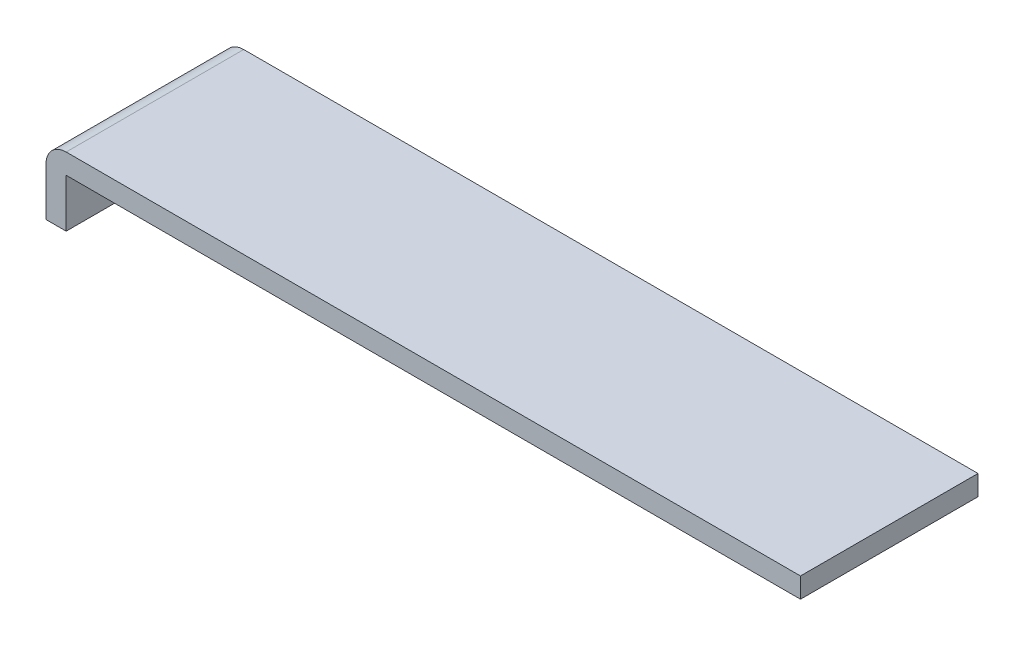
ISO-10303-21;
HEADER;
FILE_DESCRIPTION(('STEP AP214'),'2;1');
FILE_NAME('part.step','',(''),(''),'','','');
FILE_SCHEMA(('AUTOMOTIVE_DESIGN { 1 0 10303 214 1 1 1 1 }'));
ENDSEC;
DATA;
#1=APPLICATION_CONTEXT('core data for automotive mechanical design processes');
#2=APPLICATION_PROTOCOL_DEFINITION('international standard','automotive_design',2000,#1);
#3=PRODUCT_CONTEXT('',#1,'mechanical');
#4=PRODUCT('Part','Part','',(#3));
#5=PRODUCT_RELATED_PRODUCT_CATEGORY('part','',(#4));
#6=PRODUCT_DEFINITION_FORMATION('','',#4);
#7=PRODUCT_DEFINITION_CONTEXT('part definition',#1,'design');
#8=PRODUCT_DEFINITION('design','',#6,#7);
#9=PRODUCT_DEFINITION_SHAPE('','',#8);
#10=(LENGTH_UNIT() NAMED_UNIT(*) SI_UNIT(.MILLI.,.METRE.));
#11=(NAMED_UNIT(*) PLANE_ANGLE_UNIT() SI_UNIT($,.RADIAN.));
#12=(NAMED_UNIT(*) SI_UNIT($,.STERADIAN.) SOLID_ANGLE_UNIT());
#13=UNCERTAINTY_MEASURE_WITH_UNIT(LENGTH_MEASURE(1.E-05),#10,'distance_accuracy_value','');
#14=(GEOMETRIC_REPRESENTATION_CONTEXT(3) GLOBAL_UNCERTAINTY_ASSIGNED_CONTEXT((#13)) GLOBAL_UNIT_ASSIGNED_CONTEXT((#10,
#11,#12)) REPRESENTATION_CONTEXT('',''));
#15=CARTESIAN_POINT('',(0.,0.,0.));
#16=DIRECTION('',(0.,0.,1.));
#17=DIRECTION('',(1.,0.,0.));
#18=AXIS2_PLACEMENT_3D('',#15,#16,#17);
#19=CARTESIAN_POINT('',(0.5,0.,4.4));
#20=DIRECTION('',(0.,1.,0.));
#21=DIRECTION('',(-1.,0.,0.));
#22=AXIS2_PLACEMENT_3D('',#19,#20,#21);
#23=PLANE('',#22);
#24=DIRECTION('',(1.,0.,0.));
#25=VECTOR('',#24,1.);
#26=CARTESIAN_POINT('',(0.5,0.,0.));
#27=LINE('',#26,#25);
#28=CARTESIAN_POINT('',(0.,0.,0.));
#29=VERTEX_POINT('',#28);
#30=CARTESIAN_POINT('',(0.5,0.,0.));
#31=VERTEX_POINT('',#30);
#32=EDGE_CURVE('E117',#29,#31,#27,.T.);
#33=ORIENTED_EDGE('',*,*,#32,.T.);
#34=DIRECTION('',(0.,0.,-1.));
#35=VECTOR('',#34,1.);
#36=CARTESIAN_POINT('',(0.5,0.,4.4));
#37=LINE('',#36,#35);
#38=CARTESIAN_POINT('',(0.5,0.,4.4));
#39=VERTEX_POINT('',#38);
#40=EDGE_CURVE('E98',#39,#31,#37,.T.);
#41=ORIENTED_EDGE('',*,*,#40,.F.);
#42=DIRECTION('',(1.,0.,0.));
#43=VECTOR('',#42,1.);
#44=CARTESIAN_POINT('',(0.5,0.,4.4));
#45=LINE('',#44,#43);
#46=CARTESIAN_POINT('',(0.,0.,4.4));
#47=VERTEX_POINT('',#46);
#48=EDGE_CURVE('E105',#47,#39,#45,.T.);
#49=ORIENTED_EDGE('',*,*,#48,.F.);
#50=DIRECTION('',(0.,0.,-1.));
#51=VECTOR('',#50,1.);
#52=CARTESIAN_POINT('',(0.,0.,4.4));
#53=LINE('',#52,#51);
#54=EDGE_CURVE('E131',#47,#29,#53,.T.);
#55=ORIENTED_EDGE('',*,*,#54,.T.);
#56=EDGE_LOOP('',(#33,#41,#49,#55));
#57=FACE_BOUND('',#56,.T.);
#58=ADVANCED_FACE('F35',(#57),#23,.F.);
#59=CARTESIAN_POINT('',(0.5,1.2,4.4));
#60=DIRECTION('',(-1.,0.,0.));
#61=DIRECTION('',(0.,-1.,0.));
#62=AXIS2_PLACEMENT_3D('',#59,#60,#61);
#63=PLANE('',#62);
#64=DIRECTION('',(0.,1.,0.));
#65=VECTOR('',#64,1.);
#66=CARTESIAN_POINT('',(0.5,1.2,0.));
#67=LINE('',#66,#65);
#68=CARTESIAN_POINT('',(0.5,1.2,0.));
#69=VERTEX_POINT('',#68);
#70=EDGE_CURVE('E140',#31,#69,#67,.T.);
#71=ORIENTED_EDGE('',*,*,#70,.T.);
#72=DIRECTION('',(0.,0.,-1.));
#73=VECTOR('',#72,1.);
#74=CARTESIAN_POINT('',(0.5,1.2,4.4));
#75=LINE('',#74,#73);
#76=CARTESIAN_POINT('',(0.5,1.2,4.4));
#77=VERTEX_POINT('',#76);
#78=EDGE_CURVE('E101',#77,#69,#75,.T.);
#79=ORIENTED_EDGE('',*,*,#78,.F.);
#80=DIRECTION('',(0.,1.,0.));
#81=VECTOR('',#80,1.);
#82=CARTESIAN_POINT('',(0.5,1.2,4.4));
#83=LINE('',#82,#81);
#84=EDGE_CURVE('E94',#39,#77,#83,.T.);
#85=ORIENTED_EDGE('',*,*,#84,.F.);
#86=ORIENTED_EDGE('',*,*,#40,.T.);
#87=EDGE_LOOP('',(#71,#79,#85,#86));
#88=FACE_BOUND('',#87,.T.);
#89=ADVANCED_FACE('F96',(#88),#63,.F.);
#90=CARTESIAN_POINT('',(18.7,1.2,4.4));
#91=DIRECTION('',(0.,1.,0.));
#92=DIRECTION('',(-1.,0.,0.));
#93=AXIS2_PLACEMENT_3D('',#90,#91,#92);
#94=PLANE('',#93);
#95=DIRECTION('',(1.,0.,0.));
#96=VECTOR('',#95,1.);
#97=CARTESIAN_POINT('',(18.7,1.2,0.));
#98=LINE('',#97,#96);
#99=CARTESIAN_POINT('',(18.7,1.2,0.));
#100=VERTEX_POINT('',#99);
#101=EDGE_CURVE('E138',#69,#100,#98,.T.);
#102=ORIENTED_EDGE('',*,*,#101,.T.);
#103=DIRECTION('',(0.,0.,-1.));
#104=VECTOR('',#103,1.);
#105=CARTESIAN_POINT('',(18.7,1.2,4.4));
#106=LINE('',#105,#104);
#107=CARTESIAN_POINT('',(18.7,1.2,4.4));
#108=VERTEX_POINT('',#107);
#109=EDGE_CURVE('E122',#108,#100,#106,.T.);
#110=ORIENTED_EDGE('',*,*,#109,.F.);
#111=DIRECTION('',(1.,0.,0.));
#112=VECTOR('',#111,1.);
#113=CARTESIAN_POINT('',(18.7,1.2,4.4));
#114=LINE('',#113,#112);
#115=EDGE_CURVE('E104',#77,#108,#114,.T.);
#116=ORIENTED_EDGE('',*,*,#115,.F.);
#117=ORIENTED_EDGE('',*,*,#78,.T.);
#118=EDGE_LOOP('',(#102,#110,#116,#117));
#119=FACE_BOUND('',#118,.T.);
#120=ADVANCED_FACE('F152',(#119),#94,.F.);
#121=CARTESIAN_POINT('',(18.7,1.7,4.4));
#122=DIRECTION('',(-1.,0.,0.));
#123=DIRECTION('',(0.,0.,1.));
#124=AXIS2_PLACEMENT_3D('',#121,#122,#123);
#125=PLANE('',#124);
#126=DIRECTION('',(0.,1.,0.));
#127=VECTOR('',#126,1.);
#128=CARTESIAN_POINT('',(18.7,1.7,0.));
#129=LINE('',#128,#127);
#130=CARTESIAN_POINT('',(18.7,1.7,0.));
#131=VERTEX_POINT('',#130);
#132=EDGE_CURVE('E136',#100,#131,#129,.T.);
#133=ORIENTED_EDGE('',*,*,#132,.T.);
#134=DIRECTION('',(0.,0.,-1.));
#135=VECTOR('',#134,1.);
#136=CARTESIAN_POINT('',(18.7,1.7,4.4));
#137=LINE('',#136,#135);
#138=CARTESIAN_POINT('',(18.7,1.7,4.4));
#139=VERTEX_POINT('',#138);
#140=EDGE_CURVE('E128',#139,#131,#137,.T.);
#141=ORIENTED_EDGE('',*,*,#140,.F.);
#142=DIRECTION('',(0.,1.,0.));
#143=VECTOR('',#142,1.);
#144=CARTESIAN_POINT('',(18.7,1.7,4.4));
#145=LINE('',#144,#143);
#146=EDGE_CURVE('E146',#108,#139,#145,.T.);
#147=ORIENTED_EDGE('',*,*,#146,.F.);
#148=ORIENTED_EDGE('',*,*,#109,.T.);
#149=EDGE_LOOP('',(#133,#141,#147,#148));
#150=FACE_BOUND('',#149,.T.);
#151=ADVANCED_FACE('F156',(#150),#125,.F.);
#152=CARTESIAN_POINT('',(0.,1.7,4.4));
#153=DIRECTION('',(0.,-1.,0.));
#154=DIRECTION('',(0.,0.,-1.));
#155=AXIS2_PLACEMENT_3D('',#152,#153,#154);
#156=PLANE('',#155);
#157=DIRECTION('',(-1.,0.,0.));
#158=VECTOR('',#157,1.);
#159=CARTESIAN_POINT('',(0.,1.7,0.));
#160=LINE('',#159,#158);
#161=CARTESIAN_POINT('',(0.5,1.7,0.));
#162=VERTEX_POINT('',#161);
#163=EDGE_CURVE('E134',#131,#162,#160,.T.);
#164=ORIENTED_EDGE('',*,*,#163,.T.);
#165=DIRECTION('',(0.,0.,-1.));
#166=VECTOR('',#165,1.);
#167=CARTESIAN_POINT('',(0.5,1.7,4.4));
#168=LINE('',#167,#166);
#169=CARTESIAN_POINT('',(0.5,1.7,4.4));
#170=VERTEX_POINT('',#169);
#171=EDGE_CURVE('E43',#162,#170,#168,.F.);
#172=ORIENTED_EDGE('',*,*,#171,.T.);
#173=DIRECTION('',(-1.,0.,0.));
#174=VECTOR('',#173,1.);
#175=CARTESIAN_POINT('',(0.,1.7,4.4));
#176=LINE('',#175,#174);
#177=EDGE_CURVE('E144',#139,#170,#176,.T.);
#178=ORIENTED_EDGE('',*,*,#177,.F.);
#179=ORIENTED_EDGE('',*,*,#140,.T.);
#180=EDGE_LOOP('',(#164,#172,#178,#179));
#181=FACE_BOUND('',#180,.T.);
#182=ADVANCED_FACE('F157',(#181),#156,.F.);
#183=CARTESIAN_POINT('',(0.,0.,4.4));
#184=DIRECTION('',(1.,0.,0.));
#185=DIRECTION('',(0.,0.,-1.));
#186=AXIS2_PLACEMENT_3D('',#183,#184,#185);
#187=PLANE('',#186);
#188=DIRECTION('',(0.,-1.,0.));
#189=VECTOR('',#188,1.);
#190=CARTESIAN_POINT('',(0.,0.,4.4));
#191=LINE('',#190,#189);
#192=CARTESIAN_POINT('',(0.,1.2,4.4));
#193=VERTEX_POINT('',#192);
#194=EDGE_CURVE('E110',#193,#47,#191,.T.);
#195=ORIENTED_EDGE('',*,*,#194,.F.);
#196=DIRECTION('',(0.,0.,-1.));
#197=VECTOR('',#196,1.);
#198=CARTESIAN_POINT('',(0.,1.2,4.4));
#199=LINE('',#198,#197);
#200=CARTESIAN_POINT('',(0.,1.2,0.));
#201=VERTEX_POINT('',#200);
#202=EDGE_CURVE('E118',#193,#201,#199,.T.);
#203=ORIENTED_EDGE('',*,*,#202,.T.);
#204=DIRECTION('',(0.,-1.,0.));
#205=VECTOR('',#204,1.);
#206=CARTESIAN_POINT('',(0.,0.,0.));
#207=LINE('',#206,#205);
#208=EDGE_CURVE('E114',#201,#29,#207,.T.);
#209=ORIENTED_EDGE('',*,*,#208,.T.);
#210=ORIENTED_EDGE('',*,*,#54,.F.);
#211=EDGE_LOOP('',(#195,#203,#209,#210));
#212=FACE_BOUND('',#211,.T.);
#213=ADVANCED_FACE('F162',(#212),#187,.F.);
#214=CARTESIAN_POINT('',(0.,0.,4.4));
#215=DIRECTION('',(0.,0.,-1.));
#216=DIRECTION('',(-1.,0.,0.));
#217=AXIS2_PLACEMENT_3D('',#214,#215,#216);
#218=PLANE('',#217);
#219=ORIENTED_EDGE('',*,*,#177,.T.);
#220=CARTESIAN_POINT('',(0.5,1.2,4.4));
#221=DIRECTION('',(0.,0.,-1.));
#222=DIRECTION('',(-1.,0.,0.));
#223=AXIS2_PLACEMENT_3D('',#220,#221,#222);
#224=CIRCLE('',#223,0.5);
#225=EDGE_CURVE('E11',#170,#193,#224,.F.);
#226=ORIENTED_EDGE('',*,*,#225,.T.);
#227=ORIENTED_EDGE('',*,*,#194,.T.);
#228=ORIENTED_EDGE('',*,*,#48,.T.);
#229=ORIENTED_EDGE('',*,*,#84,.T.);
#230=ORIENTED_EDGE('',*,*,#115,.T.);
#231=ORIENTED_EDGE('',*,*,#146,.T.);
#232=EDGE_LOOP('',(#219,#226,#227,#228,#229,#230,#231));
#233=FACE_BOUND('',#232,.T.);
#234=ADVANCED_FACE('F108',(#233),#218,.F.);
#235=CARTESIAN_POINT('',(0.,0.,0.));
#236=DIRECTION('',(0.,0.,-1.));
#237=DIRECTION('',(-1.,0.,0.));
#238=AXIS2_PLACEMENT_3D('',#235,#236,#237);
#239=PLANE('',#238);
#240=ORIENTED_EDGE('',*,*,#208,.F.);
#241=CARTESIAN_POINT('',(0.5,1.2,0.));
#242=DIRECTION('',(0.,0.,-1.));
#243=DIRECTION('',(-1.,0.,0.));
#244=AXIS2_PLACEMENT_3D('',#241,#242,#243);
#245=CIRCLE('',#244,0.5);
#246=EDGE_CURVE('E57',#201,#162,#245,.T.);
#247=ORIENTED_EDGE('',*,*,#246,.T.);
#248=ORIENTED_EDGE('',*,*,#163,.F.);
#249=ORIENTED_EDGE('',*,*,#132,.F.);
#250=ORIENTED_EDGE('',*,*,#101,.F.);
#251=ORIENTED_EDGE('',*,*,#70,.F.);
#252=ORIENTED_EDGE('',*,*,#32,.F.);
#253=EDGE_LOOP('',(#240,#247,#248,#249,#250,#251,#252));
#254=FACE_BOUND('',#253,.T.);
#255=ADVANCED_FACE('F163',(#254),#239,.T.);
#256=CARTESIAN_POINT('',(0.5,1.2,4.4));
#257=DIRECTION('',(0.,0.,-1.));
#258=DIRECTION('',(-1.,0.,0.));
#259=AXIS2_PLACEMENT_3D('',#256,#257,#258);
#260=CYLINDRICAL_SURFACE('',#259,0.5);
#261=ORIENTED_EDGE('',*,*,#225,.F.);
#262=ORIENTED_EDGE('',*,*,#171,.F.);
#263=ORIENTED_EDGE('',*,*,#246,.F.);
#264=ORIENTED_EDGE('',*,*,#202,.F.);
#265=EDGE_LOOP('',(#261,#262,#263,#264));
#266=FACE_BOUND('',#265,.T.);
#267=ADVANCED_FACE('F37',(#266),#260,.T.);
#268=CLOSED_SHELL('',(#58,#89,#120,#151,#182,#213,#234,#255,#267));
#269=MANIFOLD_SOLID_BREP('B2',#268);
#270=ADVANCED_BREP_SHAPE_REPRESENTATION('',(#18,#269),#14);
#271=SHAPE_DEFINITION_REPRESENTATION(#9,#270);
ENDSEC;
END-ISO-10303-21;
